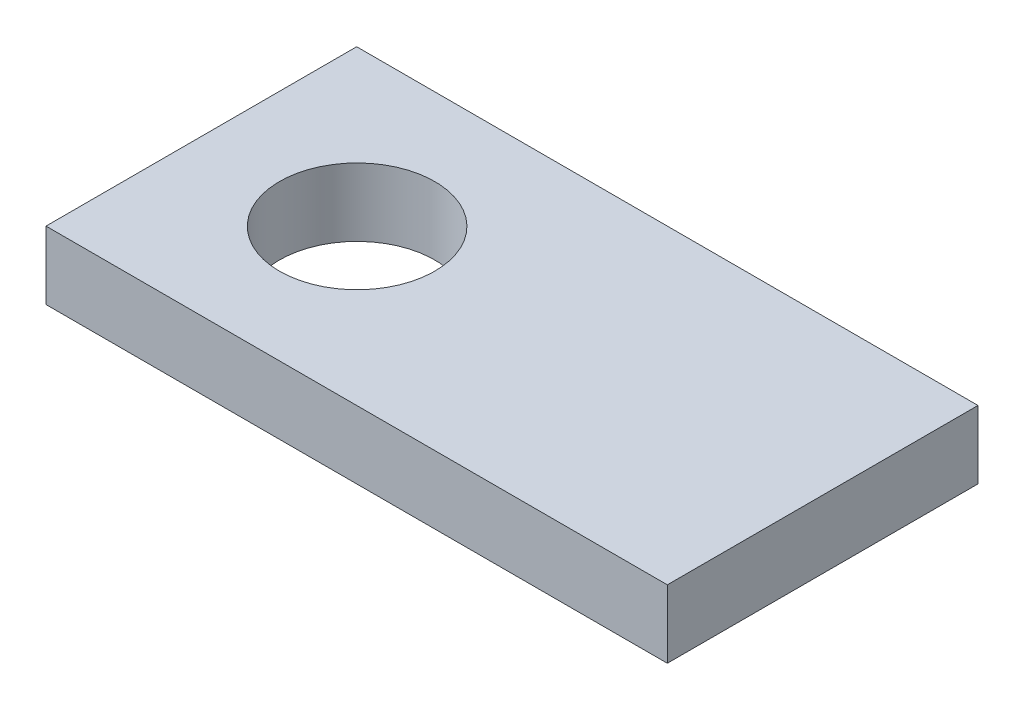
ISO-10303-21;
HEADER;
FILE_DESCRIPTION(('STEP AP214'),'2;1');
FILE_NAME('part.step','',(''),(''),'','','');
FILE_SCHEMA(('AUTOMOTIVE_DESIGN { 1 0 10303 214 1 1 1 1 }'));
ENDSEC;
DATA;
#1=APPLICATION_CONTEXT('core data for automotive mechanical design processes');
#2=APPLICATION_PROTOCOL_DEFINITION('international standard','automotive_design',2000,#1);
#3=PRODUCT_CONTEXT('',#1,'mechanical');
#4=PRODUCT('Part','Part','',(#3));
#5=PRODUCT_RELATED_PRODUCT_CATEGORY('part','',(#4));
#6=PRODUCT_DEFINITION_FORMATION('','',#4);
#7=PRODUCT_DEFINITION_CONTEXT('part definition',#1,'design');
#8=PRODUCT_DEFINITION('design','',#6,#7);
#9=PRODUCT_DEFINITION_SHAPE('','',#8);
#10=(LENGTH_UNIT() NAMED_UNIT(*) SI_UNIT(.MILLI.,.METRE.));
#11=(NAMED_UNIT(*) PLANE_ANGLE_UNIT() SI_UNIT($,.RADIAN.));
#12=(NAMED_UNIT(*) SI_UNIT($,.STERADIAN.) SOLID_ANGLE_UNIT());
#13=UNCERTAINTY_MEASURE_WITH_UNIT(LENGTH_MEASURE(1.E-05),#10,'distance_accuracy_value','');
#14=(GEOMETRIC_REPRESENTATION_CONTEXT(3) GLOBAL_UNCERTAINTY_ASSIGNED_CONTEXT((#13)) GLOBAL_UNIT_ASSIGNED_CONTEXT((#10,
#11,#12)) REPRESENTATION_CONTEXT('',''));
#15=CARTESIAN_POINT('',(0.,0.,0.));
#16=DIRECTION('',(0.,0.,1.));
#17=DIRECTION('',(1.,0.,0.));
#18=AXIS2_PLACEMENT_3D('',#15,#16,#17);
#19=CARTESIAN_POINT('',(0.,11.1125,0.));
#20=DIRECTION('',(0.,-1.,0.));
#21=DIRECTION('',(0.,0.,-1.));
#22=AXIS2_PLACEMENT_3D('',#19,#20,#21);
#23=PLANE('',#22);
#24=DIRECTION('',(0.,0.,-1.));
#25=VECTOR('',#24,1.);
#26=CARTESIAN_POINT('',(50.8,11.1125,25.4));
#27=LINE('',#26,#25);
#28=CARTESIAN_POINT('',(50.8,11.1125,25.4));
#29=VERTEX_POINT('',#28);
#30=CARTESIAN_POINT('',(50.8,11.1125,-25.4));
#31=VERTEX_POINT('',#30);
#32=EDGE_CURVE('E86',#29,#31,#27,.T.);
#33=ORIENTED_EDGE('',*,*,#32,.T.);
#34=DIRECTION('',(-1.,0.,0.));
#35=VECTOR('',#34,1.);
#36=CARTESIAN_POINT('',(-50.8,11.1125,-25.4));
#37=LINE('',#36,#35);
#38=CARTESIAN_POINT('',(-50.8,11.1125,-25.4));
#39=VERTEX_POINT('',#38);
#40=EDGE_CURVE('E81',#31,#39,#37,.T.);
#41=ORIENTED_EDGE('',*,*,#40,.T.);
#42=DIRECTION('',(0.,0.,1.));
#43=VECTOR('',#42,1.);
#44=CARTESIAN_POINT('',(-50.8,11.1125,25.4));
#45=LINE('',#44,#43);
#46=CARTESIAN_POINT('',(-50.8,11.1125,25.4));
#47=VERTEX_POINT('',#46);
#48=EDGE_CURVE('E84',#39,#47,#45,.T.);
#49=ORIENTED_EDGE('',*,*,#48,.T.);
#50=DIRECTION('',(1.,0.,0.));
#51=VECTOR('',#50,1.);
#52=CARTESIAN_POINT('',(-50.8,11.1125,25.4));
#53=LINE('',#52,#51);
#54=EDGE_CURVE('E51',#47,#29,#53,.T.);
#55=ORIENTED_EDGE('',*,*,#54,.T.);
#56=EDGE_LOOP('',(#33,#41,#49,#55));
#57=FACE_BOUND('',#56,.T.);
#58=CARTESIAN_POINT('',(-25.3257402965,11.1125,0.));
#59=DIRECTION('',(0.,1.,0.));
#60=DIRECTION('',(0.,0.,1.));
#61=AXIS2_PLACEMENT_3D('',#58,#59,#60);
#62=CIRCLE('',#61,12.7);
#63=CARTESIAN_POINT('',(-25.3257402965,11.1125,12.7));
#64=VERTEX_POINT('',#63);
#65=EDGE_CURVE('E101',#64,#64,#62,.T.);
#66=ORIENTED_EDGE('',*,*,#65,.F.);
#67=EDGE_LOOP('',(#66));
#68=FACE_BOUND('',#67,.T.);
#69=ADVANCED_FACE('F34',(#57,#68),#23,.F.);
#70=CARTESIAN_POINT('',(0.,0.,0.));
#71=DIRECTION('',(0.,-1.,0.));
#72=DIRECTION('',(0.,0.,-1.));
#73=AXIS2_PLACEMENT_3D('',#70,#71,#72);
#74=PLANE('',#73);
#75=DIRECTION('',(0.,0.,-1.));
#76=VECTOR('',#75,1.);
#77=CARTESIAN_POINT('',(50.8,0.,25.4));
#78=LINE('',#77,#76);
#79=CARTESIAN_POINT('',(50.8,0.,25.4));
#80=VERTEX_POINT('',#79);
#81=CARTESIAN_POINT('',(50.8,0.,-25.4));
#82=VERTEX_POINT('',#81);
#83=EDGE_CURVE('E98',#80,#82,#78,.T.);
#84=ORIENTED_EDGE('',*,*,#83,.F.);
#85=DIRECTION('',(1.,0.,0.));
#86=VECTOR('',#85,1.);
#87=CARTESIAN_POINT('',(-50.8,0.,25.4));
#88=LINE('',#87,#86);
#89=CARTESIAN_POINT('',(-50.8,0.,25.4));
#90=VERTEX_POINT('',#89);
#91=EDGE_CURVE('E74',#90,#80,#88,.T.);
#92=ORIENTED_EDGE('',*,*,#91,.F.);
#93=DIRECTION('',(0.,0.,1.));
#94=VECTOR('',#93,1.);
#95=CARTESIAN_POINT('',(-50.8,0.,25.4));
#96=LINE('',#95,#94);
#97=CARTESIAN_POINT('',(-50.8,0.,-25.4));
#98=VERTEX_POINT('',#97);
#99=EDGE_CURVE('E68',#98,#90,#96,.T.);
#100=ORIENTED_EDGE('',*,*,#99,.F.);
#101=DIRECTION('',(-1.,0.,0.));
#102=VECTOR('',#101,1.);
#103=CARTESIAN_POINT('',(-50.8,0.,-25.4));
#104=LINE('',#103,#102);
#105=EDGE_CURVE('E90',#82,#98,#104,.T.);
#106=ORIENTED_EDGE('',*,*,#105,.F.);
#107=EDGE_LOOP('',(#84,#92,#100,#106));
#108=FACE_BOUND('',#107,.T.);
#109=CARTESIAN_POINT('',(-25.3257402965,0.,0.));
#110=DIRECTION('',(0.,1.,0.));
#111=DIRECTION('',(0.,0.,1.));
#112=AXIS2_PLACEMENT_3D('',#109,#110,#111);
#113=CIRCLE('',#112,12.7);
#114=CARTESIAN_POINT('',(-25.3257402965,0.,12.7));
#115=VERTEX_POINT('',#114);
#116=EDGE_CURVE('E113',#115,#115,#113,.T.);
#117=ORIENTED_EDGE('',*,*,#116,.T.);
#118=EDGE_LOOP('',(#117));
#119=FACE_BOUND('',#118,.T.);
#120=ADVANCED_FACE('F109',(#108,#119),#74,.T.);
#121=CARTESIAN_POINT('',(50.8,11.1125,25.4));
#122=DIRECTION('',(-1.,0.,0.));
#123=DIRECTION('',(0.,0.,1.));
#124=AXIS2_PLACEMENT_3D('',#121,#122,#123);
#125=PLANE('',#124);
#126=ORIENTED_EDGE('',*,*,#83,.T.);
#127=DIRECTION('',(0.,-1.,0.));
#128=VECTOR('',#127,1.);
#129=CARTESIAN_POINT('',(50.8,11.1125,-25.4));
#130=LINE('',#129,#128);
#131=EDGE_CURVE('E11',#31,#82,#130,.T.);
#132=ORIENTED_EDGE('',*,*,#131,.F.);
#133=ORIENTED_EDGE('',*,*,#32,.F.);
#134=DIRECTION('',(0.,-1.,0.));
#135=VECTOR('',#134,1.);
#136=CARTESIAN_POINT('',(50.8,11.1125,25.4));
#137=LINE('',#136,#135);
#138=EDGE_CURVE('E94',#29,#80,#137,.T.);
#139=ORIENTED_EDGE('',*,*,#138,.T.);
#140=EDGE_LOOP('',(#126,#132,#133,#139));
#141=FACE_BOUND('',#140,.T.);
#142=ADVANCED_FACE('F36',(#141),#125,.F.);
#143=CARTESIAN_POINT('',(-50.8,11.1125,-25.4));
#144=DIRECTION('',(0.,0.,1.));
#145=DIRECTION('',(1.,0.,0.));
#146=AXIS2_PLACEMENT_3D('',#143,#144,#145);
#147=PLANE('',#146);
#148=ORIENTED_EDGE('',*,*,#105,.T.);
#149=DIRECTION('',(0.,-1.,0.));
#150=VECTOR('',#149,1.);
#151=CARTESIAN_POINT('',(-50.8,11.1125,-25.4));
#152=LINE('',#151,#150);
#153=EDGE_CURVE('E43',#39,#98,#152,.T.);
#154=ORIENTED_EDGE('',*,*,#153,.F.);
#155=ORIENTED_EDGE('',*,*,#40,.F.);
#156=ORIENTED_EDGE('',*,*,#131,.T.);
#157=EDGE_LOOP('',(#148,#154,#155,#156));
#158=FACE_BOUND('',#157,.T.);
#159=ADVANCED_FACE('F89',(#158),#147,.F.);
#160=CARTESIAN_POINT('',(-50.8,11.1125,25.4));
#161=DIRECTION('',(1.,0.,0.));
#162=DIRECTION('',(0.,0.,-1.));
#163=AXIS2_PLACEMENT_3D('',#160,#161,#162);
#164=PLANE('',#163);
#165=ORIENTED_EDGE('',*,*,#99,.T.);
#166=DIRECTION('',(0.,-1.,0.));
#167=VECTOR('',#166,1.);
#168=CARTESIAN_POINT('',(-50.8,11.1125,25.4));
#169=LINE('',#168,#167);
#170=EDGE_CURVE('E91',#47,#90,#169,.T.);
#171=ORIENTED_EDGE('',*,*,#170,.F.);
#172=ORIENTED_EDGE('',*,*,#48,.F.);
#173=ORIENTED_EDGE('',*,*,#153,.T.);
#174=EDGE_LOOP('',(#165,#171,#172,#173));
#175=FACE_BOUND('',#174,.T.);
#176=ADVANCED_FACE('F92',(#175),#164,.F.);
#177=CARTESIAN_POINT('',(-50.8,11.1125,25.4));
#178=DIRECTION('',(0.,0.,-1.));
#179=DIRECTION('',(-1.,0.,0.));
#180=AXIS2_PLACEMENT_3D('',#177,#178,#179);
#181=PLANE('',#180);
#182=ORIENTED_EDGE('',*,*,#91,.T.);
#183=ORIENTED_EDGE('',*,*,#138,.F.);
#184=ORIENTED_EDGE('',*,*,#54,.F.);
#185=ORIENTED_EDGE('',*,*,#170,.T.);
#186=EDGE_LOOP('',(#182,#183,#184,#185));
#187=FACE_BOUND('',#186,.T.);
#188=ADVANCED_FACE('F106',(#187),#181,.F.);
#189=CARTESIAN_POINT('',(-25.3257402965,11.1125,0.));
#190=DIRECTION('',(0.,-1.,0.));
#191=DIRECTION('',(0.,0.,-1.));
#192=AXIS2_PLACEMENT_3D('',#189,#190,#191);
#193=CYLINDRICAL_SURFACE('',#192,12.7);
#194=ORIENTED_EDGE('',*,*,#65,.T.);
#195=EDGE_LOOP('',(#194));
#196=FACE_BOUND('',#195,.T.);
#197=ORIENTED_EDGE('',*,*,#116,.F.);
#198=EDGE_LOOP('',(#197));
#199=FACE_BOUND('',#198,.T.);
#200=ADVANCED_FACE('F119',(#196,#199),#193,.F.);
#201=CLOSED_SHELL('',(#69,#120,#142,#159,#176,#188,#200));
#202=MANIFOLD_SOLID_BREP('B2',#201);
#203=ADVANCED_BREP_SHAPE_REPRESENTATION('',(#18,#202),#14);
#204=SHAPE_DEFINITION_REPRESENTATION(#9,#203);
ENDSEC;
END-ISO-10303-21;
